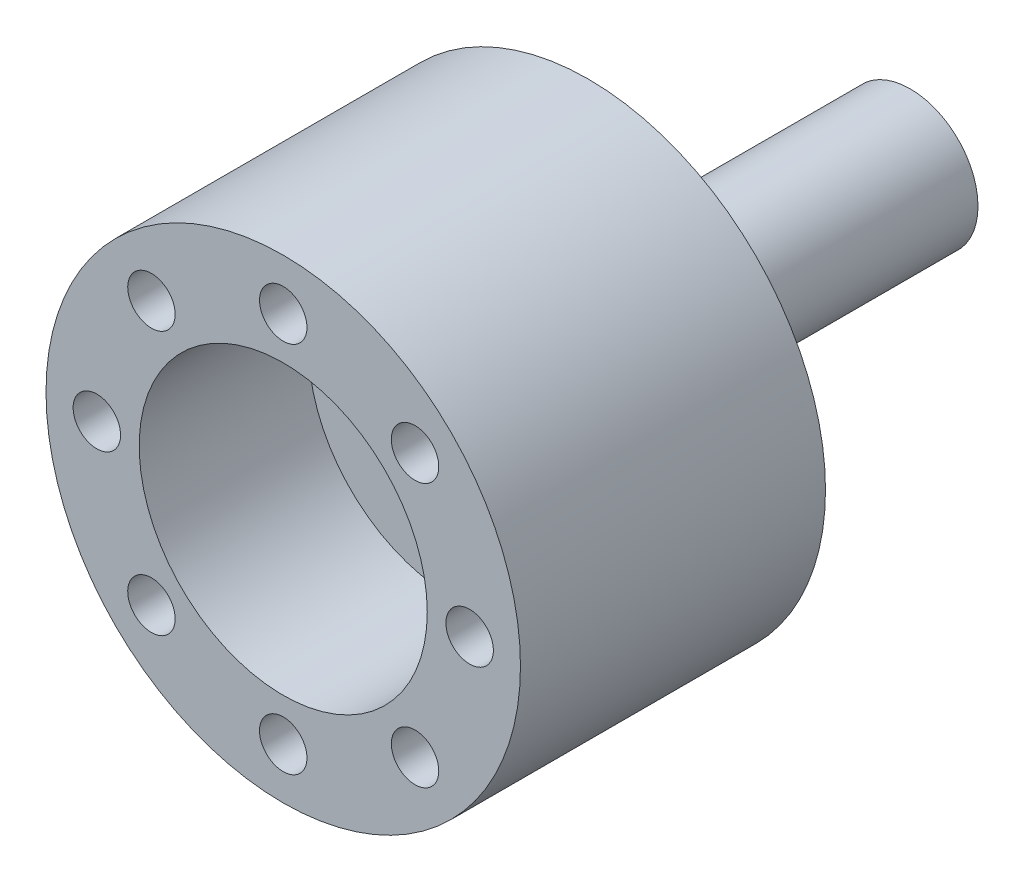
ISO-10303-21;
HEADER;
FILE_DESCRIPTION(('STEP AP214'),'2;1');
FILE_NAME('part.step','',(''),(''),'','','');
FILE_SCHEMA(('AUTOMOTIVE_DESIGN { 1 0 10303 214 1 1 1 1 }'));
ENDSEC;
DATA;
#1=APPLICATION_CONTEXT('core data for automotive mechanical design processes');
#2=APPLICATION_PROTOCOL_DEFINITION('international standard','automotive_design',2000,#1);
#3=PRODUCT_CONTEXT('',#1,'mechanical');
#4=PRODUCT('Part','Part','',(#3));
#5=PRODUCT_RELATED_PRODUCT_CATEGORY('part','',(#4));
#6=PRODUCT_DEFINITION_FORMATION('','',#4);
#7=PRODUCT_DEFINITION_CONTEXT('part definition',#1,'design');
#8=PRODUCT_DEFINITION('design','',#6,#7);
#9=PRODUCT_DEFINITION_SHAPE('','',#8);
#10=(LENGTH_UNIT() NAMED_UNIT(*) SI_UNIT(.MILLI.,.METRE.));
#11=(NAMED_UNIT(*) PLANE_ANGLE_UNIT() SI_UNIT($,.RADIAN.));
#12=(NAMED_UNIT(*) SI_UNIT($,.STERADIAN.) SOLID_ANGLE_UNIT());
#13=UNCERTAINTY_MEASURE_WITH_UNIT(LENGTH_MEASURE(1.E-05),#10,'distance_accuracy_value','');
#14=(GEOMETRIC_REPRESENTATION_CONTEXT(3) GLOBAL_UNCERTAINTY_ASSIGNED_CONTEXT((#13)) GLOBAL_UNIT_ASSIGNED_CONTEXT((#10,
#11,#12)) REPRESENTATION_CONTEXT('',''));
#15=CARTESIAN_POINT('',(0.,0.,0.));
#16=DIRECTION('',(0.,0.,1.));
#17=DIRECTION('',(1.,0.,0.));
#18=AXIS2_PLACEMENT_3D('',#15,#16,#17);
#19=CARTESIAN_POINT('',(4.6550416688057,4.17050201554713,3.));
#20=DIRECTION('',(0.,0.,1.));
#21=DIRECTION('',(1.,0.,0.));
#22=AXIS2_PLACEMENT_3D('',#19,#20,#21);
#23=CYLINDRICAL_SURFACE('',#22,1.45);
#24=CARTESIAN_POINT('',(4.6550416688057,4.17050201554713,8.));
#25=DIRECTION('',(0.,0.,1.));
#26=DIRECTION('',(1.,0.,0.));
#27=AXIS2_PLACEMENT_3D('',#24,#25,#26);
#28=CIRCLE('',#27,1.45);
#29=CARTESIAN_POINT('',(6.1050416688057,4.17050201554713,8.));
#30=VERTEX_POINT('',#29);
#31=EDGE_CURVE('E81',#30,#30,#28,.F.);
#32=ORIENTED_EDGE('',*,*,#31,.F.);
#33=EDGE_LOOP('',(#32));
#34=FACE_BOUND('',#33,.T.);
#35=CARTESIAN_POINT('',(4.6550416688057,4.17050201554713,5.));
#36=DIRECTION('',(0.,0.,-1.));
#37=DIRECTION('',(-1.,0.,0.));
#38=AXIS2_PLACEMENT_3D('',#35,#36,#37);
#39=CIRCLE('',#38,1.45);
#40=CARTESIAN_POINT('',(3.2050416688057,4.17050201554713,5.));
#41=VERTEX_POINT('',#40);
#42=EDGE_CURVE('E38',#41,#41,#39,.F.);
#43=ORIENTED_EDGE('',*,*,#42,.F.);
#44=EDGE_LOOP('',(#43));
#45=FACE_BOUND('',#44,.T.);
#46=ADVANCED_FACE('F34',(#34,#45),#23,.F.);
#47=CARTESIAN_POINT('',(-7.77817459305193,7.77817459305212,12.));
#48=DIRECTION('',(0.,0.,1.));
#49=DIRECTION('',(1.,0.,0.));
#50=AXIS2_PLACEMENT_3D('',#47,#48,#49);
#51=CYLINDRICAL_SURFACE('',#50,1.4);
#52=CARTESIAN_POINT('',(-7.77817459305193,7.77817459305212,18.));
#53=DIRECTION('',(0.,0.,1.));
#54=DIRECTION('',(0.707106781186556,0.707106781186539,0.));
#55=AXIS2_PLACEMENT_3D('',#52,#53,#54);
#56=CIRCLE('',#55,1.4);
#57=CARTESIAN_POINT('',(-6.78822509939075,8.76812408671327,18.));
#58=VERTEX_POINT('',#57);
#59=EDGE_CURVE('E55',#58,#58,#56,.T.);
#60=ORIENTED_EDGE('',*,*,#59,.T.);
#61=EDGE_LOOP('',(#60));
#62=FACE_BOUND('',#61,.T.);
#63=CARTESIAN_POINT('',(-7.77817459305193,7.77817459305212,15.));
#64=DIRECTION('',(0.,0.,-1.));
#65=DIRECTION('',(-1.,0.,0.));
#66=AXIS2_PLACEMENT_3D('',#63,#64,#65);
#67=CIRCLE('',#66,1.4);
#68=CARTESIAN_POINT('',(-9.17817459305193,7.77817459305212,15.));
#69=VERTEX_POINT('',#68);
#70=EDGE_CURVE('E78',#69,#69,#67,.F.);
#71=ORIENTED_EDGE('',*,*,#70,.F.);
#72=EDGE_LOOP('',(#71));
#73=FACE_BOUND('',#72,.T.);
#74=ADVANCED_FACE('F185',(#62,#73),#51,.F.);
#75=CARTESIAN_POINT('',(-11.,1.15218884181823E-13,12.));
#76=DIRECTION('',(0.,0.,1.));
#77=DIRECTION('',(1.,0.,0.));
#78=AXIS2_PLACEMENT_3D('',#75,#76,#77);
#79=CYLINDRICAL_SURFACE('',#78,1.4);
#80=CARTESIAN_POINT('',(-11.,1.15218884181823E-13,18.));
#81=DIRECTION('',(0.,0.,1.));
#82=DIRECTION('',(0.,1.,0.));
#83=AXIS2_PLACEMENT_3D('',#80,#81,#82);
#84=CIRCLE('',#83,1.4);
#85=CARTESIAN_POINT('',(-11.,1.40000000000012,18.));
#86=VERTEX_POINT('',#85);
#87=EDGE_CURVE('E156',#86,#86,#84,.T.);
#88=ORIENTED_EDGE('',*,*,#87,.T.);
#89=EDGE_LOOP('',(#88));
#90=FACE_BOUND('',#89,.T.);
#91=CARTESIAN_POINT('',(-11.,1.15218884181823E-13,15.));
#92=DIRECTION('',(0.,0.,-1.));
#93=DIRECTION('',(-1.,0.,0.));
#94=AXIS2_PLACEMENT_3D('',#91,#92,#93);
#95=CIRCLE('',#94,1.4);
#96=CARTESIAN_POINT('',(-12.4,1.15218884181823E-13,15.));
#97=VERTEX_POINT('',#96);
#98=EDGE_CURVE('E75',#97,#97,#95,.F.);
#99=ORIENTED_EDGE('',*,*,#98,.F.);
#100=EDGE_LOOP('',(#99));
#101=FACE_BOUND('',#100,.T.);
#102=ADVANCED_FACE('F190',(#90,#101),#79,.F.);
#103=CARTESIAN_POINT('',(-7.77817459305209,-7.77817459305195,12.));
#104=DIRECTION('',(0.,0.,1.));
#105=DIRECTION('',(1.,0.,0.));
#106=AXIS2_PLACEMENT_3D('',#103,#104,#105);
#107=CYLINDRICAL_SURFACE('',#106,1.4);
#108=CARTESIAN_POINT('',(-7.77817459305209,-7.77817459305195,18.));
#109=DIRECTION('',(0.,0.,1.));
#110=DIRECTION('',(-0.707106781186541,0.707106781186554,0.));
#111=AXIS2_PLACEMENT_3D('',#108,#109,#110);
#112=CIRCLE('',#111,1.4);
#113=CARTESIAN_POINT('',(-8.76812408671325,-6.78822509939078,18.));
#114=VERTEX_POINT('',#113);
#115=EDGE_CURVE('E153',#114,#114,#112,.T.);
#116=ORIENTED_EDGE('',*,*,#115,.T.);
#117=EDGE_LOOP('',(#116));
#118=FACE_BOUND('',#117,.T.);
#119=CARTESIAN_POINT('',(-7.77817459305209,-7.77817459305195,15.));
#120=DIRECTION('',(0.,0.,-1.));
#121=DIRECTION('',(-1.,0.,0.));
#122=AXIS2_PLACEMENT_3D('',#119,#120,#121);
#123=CIRCLE('',#122,1.4);
#124=CARTESIAN_POINT('',(-9.17817459305209,-7.77817459305195,15.));
#125=VERTEX_POINT('',#124);
#126=EDGE_CURVE('E72',#125,#125,#123,.F.);
#127=ORIENTED_EDGE('',*,*,#126,.F.);
#128=EDGE_LOOP('',(#127));
#129=FACE_BOUND('',#128,.T.);
#130=ADVANCED_FACE('F203',(#118,#129),#107,.F.);
#131=CARTESIAN_POINT('',(0.,-11.,12.));
#132=DIRECTION('',(0.,0.,1.));
#133=DIRECTION('',(1.,0.,0.));
#134=AXIS2_PLACEMENT_3D('',#131,#132,#133);
#135=CYLINDRICAL_SURFACE('',#134,1.4);
#136=CARTESIAN_POINT('',(0.,-11.,18.));
#137=DIRECTION('',(0.,0.,1.));
#138=DIRECTION('',(-1.,0.,0.));
#139=AXIS2_PLACEMENT_3D('',#136,#137,#138);
#140=CIRCLE('',#139,1.4);
#141=CARTESIAN_POINT('',(-1.4,-11.,18.));
#142=VERTEX_POINT('',#141);
#143=EDGE_CURVE('E150',#142,#142,#140,.T.);
#144=ORIENTED_EDGE('',*,*,#143,.T.);
#145=EDGE_LOOP('',(#144));
#146=FACE_BOUND('',#145,.T.);
#147=CARTESIAN_POINT('',(0.,-11.,15.));
#148=DIRECTION('',(0.,0.,-1.));
#149=DIRECTION('',(-1.,0.,0.));
#150=AXIS2_PLACEMENT_3D('',#147,#148,#149);
#151=CIRCLE('',#150,1.4);
#152=CARTESIAN_POINT('',(-1.4,-11.,15.));
#153=VERTEX_POINT('',#152);
#154=EDGE_CURVE('E69',#153,#153,#151,.F.);
#155=ORIENTED_EDGE('',*,*,#154,.F.);
#156=EDGE_LOOP('',(#155));
#157=FACE_BOUND('',#156,.T.);
#158=ADVANCED_FACE('F207',(#146,#157),#135,.F.);
#159=CARTESIAN_POINT('',(7.77817459305198,-7.77817459305206,12.));
#160=DIRECTION('',(0.,0.,1.));
#161=DIRECTION('',(1.,0.,0.));
#162=AXIS2_PLACEMENT_3D('',#159,#160,#161);
#163=CYLINDRICAL_SURFACE('',#162,1.4);
#164=CARTESIAN_POINT('',(7.77817459305198,-7.77817459305206,18.));
#165=DIRECTION('',(0.,0.,1.));
#166=DIRECTION('',(-0.707106781186551,-0.707106781186544,0.));
#167=AXIS2_PLACEMENT_3D('',#164,#165,#166);
#168=CIRCLE('',#167,1.4);
#169=CARTESIAN_POINT('',(6.78822509939081,-8.76812408671322,18.));
#170=VERTEX_POINT('',#169);
#171=EDGE_CURVE('E147',#170,#170,#168,.T.);
#172=ORIENTED_EDGE('',*,*,#171,.T.);
#173=EDGE_LOOP('',(#172));
#174=FACE_BOUND('',#173,.T.);
#175=CARTESIAN_POINT('',(7.77817459305198,-7.77817459305206,15.));
#176=DIRECTION('',(0.,0.,-1.));
#177=DIRECTION('',(-1.,0.,0.));
#178=AXIS2_PLACEMENT_3D('',#175,#176,#177);
#179=CIRCLE('',#178,1.4);
#180=CARTESIAN_POINT('',(6.37817459305198,-7.77817459305206,15.));
#181=VERTEX_POINT('',#180);
#182=EDGE_CURVE('E65',#181,#181,#179,.F.);
#183=ORIENTED_EDGE('',*,*,#182,.F.);
#184=EDGE_LOOP('',(#183));
#185=FACE_BOUND('',#184,.T.);
#186=ADVANCED_FACE('F211',(#174,#185),#163,.F.);
#187=CARTESIAN_POINT('',(11.,0.,12.));
#188=DIRECTION('',(0.,0.,1.));
#189=DIRECTION('',(1.,0.,0.));
#190=AXIS2_PLACEMENT_3D('',#187,#188,#189);
#191=CYLINDRICAL_SURFACE('',#190,1.4);
#192=CARTESIAN_POINT('',(11.,0.,18.));
#193=DIRECTION('',(0.,0.,1.));
#194=DIRECTION('',(0.,-1.,0.));
#195=AXIS2_PLACEMENT_3D('',#192,#193,#194);
#196=CIRCLE('',#195,1.4);
#197=CARTESIAN_POINT('',(11.,-1.40000000000004,18.));
#198=VERTEX_POINT('',#197);
#199=EDGE_CURVE('E143',#198,#198,#196,.T.);
#200=ORIENTED_EDGE('',*,*,#199,.T.);
#201=EDGE_LOOP('',(#200));
#202=FACE_BOUND('',#201,.T.);
#203=CARTESIAN_POINT('',(11.,0.,15.));
#204=DIRECTION('',(0.,0.,-1.));
#205=DIRECTION('',(-1.,0.,0.));
#206=AXIS2_PLACEMENT_3D('',#203,#204,#205);
#207=CIRCLE('',#206,1.4);
#208=CARTESIAN_POINT('',(9.6,0.,15.));
#209=VERTEX_POINT('',#208);
#210=EDGE_CURVE('E62',#209,#209,#207,.F.);
#211=ORIENTED_EDGE('',*,*,#210,.F.);
#212=EDGE_LOOP('',(#211));
#213=FACE_BOUND('',#212,.T.);
#214=ADVANCED_FACE('F199',(#202,#213),#191,.F.);
#215=CARTESIAN_POINT('',(7.77817459305204,7.77817459305201,12.));
#216=DIRECTION('',(0.,0.,1.));
#217=DIRECTION('',(1.,0.,0.));
#218=AXIS2_PLACEMENT_3D('',#215,#216,#217);
#219=CYLINDRICAL_SURFACE('',#218,1.4);
#220=CARTESIAN_POINT('',(7.77817459305204,7.77817459305201,18.));
#221=DIRECTION('',(0.,0.,1.));
#222=DIRECTION('',(0.707106781186546,-0.707106781186549,0.));
#223=AXIS2_PLACEMENT_3D('',#220,#221,#222);
#224=CIRCLE('',#223,1.4);
#225=CARTESIAN_POINT('',(8.7681240867132,6.78822509939084,18.));
#226=VERTEX_POINT('',#225);
#227=EDGE_CURVE('E146',#226,#226,#224,.T.);
#228=ORIENTED_EDGE('',*,*,#227,.T.);
#229=EDGE_LOOP('',(#228));
#230=FACE_BOUND('',#229,.T.);
#231=CARTESIAN_POINT('',(7.77817459305204,7.77817459305201,15.));
#232=DIRECTION('',(0.,0.,-1.));
#233=DIRECTION('',(-1.,0.,0.));
#234=AXIS2_PLACEMENT_3D('',#231,#232,#233);
#235=CIRCLE('',#234,1.4);
#236=CARTESIAN_POINT('',(6.37817459305204,7.77817459305201,15.));
#237=VERTEX_POINT('',#236);
#238=EDGE_CURVE('E57',#237,#237,#235,.F.);
#239=ORIENTED_EDGE('',*,*,#238,.F.);
#240=EDGE_LOOP('',(#239));
#241=FACE_BOUND('',#240,.T.);
#242=ADVANCED_FACE('F197',(#230,#241),#219,.F.);
#243=CARTESIAN_POINT('',(0.,11.,12.));
#244=DIRECTION('',(0.,0.,1.));
#245=DIRECTION('',(1.,0.,0.));
#246=AXIS2_PLACEMENT_3D('',#243,#244,#245);
#247=CYLINDRICAL_SURFACE('',#246,1.4);
#248=CARTESIAN_POINT('',(0.,11.,18.));
#249=DIRECTION('',(0.,0.,1.));
#250=DIRECTION('',(1.,0.,0.));
#251=AXIS2_PLACEMENT_3D('',#248,#249,#250);
#252=CIRCLE('',#251,1.4);
#253=CARTESIAN_POINT('',(1.4,11.,18.));
#254=VERTEX_POINT('',#253);
#255=EDGE_CURVE('E47',#254,#254,#252,.T.);
#256=ORIENTED_EDGE('',*,*,#255,.T.);
#257=EDGE_LOOP('',(#256));
#258=FACE_BOUND('',#257,.T.);
#259=CARTESIAN_POINT('',(0.,11.,15.));
#260=DIRECTION('',(0.,0.,-1.));
#261=DIRECTION('',(-1.,0.,0.));
#262=AXIS2_PLACEMENT_3D('',#259,#260,#261);
#263=CIRCLE('',#262,1.4);
#264=CARTESIAN_POINT('',(-1.4,11.,15.));
#265=VERTEX_POINT('',#264);
#266=EDGE_CURVE('E52',#265,#265,#263,.F.);
#267=ORIENTED_EDGE('',*,*,#266,.F.);
#268=EDGE_LOOP('',(#267));
#269=FACE_BOUND('',#268,.T.);
#270=ADVANCED_FACE('F166',(#258,#269),#247,.F.);
#271=CARTESIAN_POINT('',(0.,0.,18.));
#272=DIRECTION('',(0.,0.,-1.));
#273=DIRECTION('',(-1.,0.,0.));
#274=AXIS2_PLACEMENT_3D('',#271,#272,#273);
#275=CYLINDRICAL_SURFACE('',#274,14.);
#276=CARTESIAN_POINT('',(0.,0.,18.));
#277=DIRECTION('',(0.,0.,1.));
#278=DIRECTION('',(1.,0.,0.));
#279=AXIS2_PLACEMENT_3D('',#276,#277,#278);
#280=CIRCLE('',#279,14.);
#281=CARTESIAN_POINT('',(14.,0.,18.));
#282=VERTEX_POINT('',#281);
#283=EDGE_CURVE('E10',#282,#282,#280,.T.);
#284=ORIENTED_EDGE('',*,*,#283,.F.);
#285=EDGE_LOOP('',(#284));
#286=FACE_BOUND('',#285,.T.);
#287=CARTESIAN_POINT('',(0.,0.,0.));
#288=DIRECTION('',(0.,0.,1.));
#289=DIRECTION('',(1.,0.,0.));
#290=AXIS2_PLACEMENT_3D('',#287,#288,#289);
#291=CIRCLE('',#290,14.);
#292=CARTESIAN_POINT('',(14.,0.,0.));
#293=VERTEX_POINT('',#292);
#294=EDGE_CURVE('E42',#293,#293,#291,.T.);
#295=ORIENTED_EDGE('',*,*,#294,.T.);
#296=EDGE_LOOP('',(#295));
#297=FACE_BOUND('',#296,.T.);
#298=ADVANCED_FACE('F36',(#286,#297),#275,.T.);
#299=CARTESIAN_POINT('',(0.,0.,18.));
#300=DIRECTION('',(0.,0.,1.));
#301=DIRECTION('',(1.,0.,0.));
#302=AXIS2_PLACEMENT_3D('',#299,#300,#301);
#303=PLANE('',#302);
#304=CARTESIAN_POINT('',(0.,0.,18.));
#305=DIRECTION('',(0.,0.,1.));
#306=DIRECTION('',(1.,0.,0.));
#307=AXIS2_PLACEMENT_3D('',#304,#305,#306);
#308=CIRCLE('',#307,8.5);
#309=CARTESIAN_POINT('',(8.5,0.,18.));
#310=VERTEX_POINT('',#309);
#311=EDGE_CURVE('E91',#310,#310,#308,.T.);
#312=ORIENTED_EDGE('',*,*,#311,.F.);
#313=EDGE_LOOP('',(#312));
#314=FACE_BOUND('',#313,.T.);
#315=ORIENTED_EDGE('',*,*,#199,.F.);
#316=EDGE_LOOP('',(#315));
#317=FACE_BOUND('',#316,.T.);
#318=ORIENTED_EDGE('',*,*,#171,.F.);
#319=EDGE_LOOP('',(#318));
#320=FACE_BOUND('',#319,.T.);
#321=ORIENTED_EDGE('',*,*,#143,.F.);
#322=EDGE_LOOP('',(#321));
#323=FACE_BOUND('',#322,.T.);
#324=ORIENTED_EDGE('',*,*,#115,.F.);
#325=EDGE_LOOP('',(#324));
#326=FACE_BOUND('',#325,.T.);
#327=ORIENTED_EDGE('',*,*,#87,.F.);
#328=EDGE_LOOP('',(#327));
#329=FACE_BOUND('',#328,.T.);
#330=ORIENTED_EDGE('',*,*,#59,.F.);
#331=EDGE_LOOP('',(#330));
#332=FACE_BOUND('',#331,.T.);
#333=ORIENTED_EDGE('',*,*,#227,.F.);
#334=EDGE_LOOP('',(#333));
#335=FACE_BOUND('',#334,.T.);
#336=ORIENTED_EDGE('',*,*,#255,.F.);
#337=EDGE_LOOP('',(#336));
#338=FACE_BOUND('',#337,.T.);
#339=ORIENTED_EDGE('',*,*,#283,.T.);
#340=EDGE_LOOP('',(#339));
#341=FACE_BOUND('',#340,.T.);
#342=ADVANCED_FACE('F169',(#314,#317,#320,#323,#326,#329,#332,#335,#338,#341),#303,.T.);
#343=CARTESIAN_POINT('',(0.,0.,0.));
#344=DIRECTION('',(0.,0.,1.));
#345=DIRECTION('',(1.,0.,0.));
#346=AXIS2_PLACEMENT_3D('',#343,#344,#345);
#347=PLANE('',#346);
#348=CARTESIAN_POINT('',(0.,0.,0.));
#349=DIRECTION('',(0.,0.,-1.));
#350=DIRECTION('',(-1.,0.,0.));
#351=AXIS2_PLACEMENT_3D('',#348,#349,#350);
#352=CIRCLE('',#351,7.75);
#353=CARTESIAN_POINT('',(-7.75,0.,0.));
#354=VERTEX_POINT('',#353);
#355=EDGE_CURVE('E98',#354,#354,#352,.T.);
#356=ORIENTED_EDGE('',*,*,#355,.F.);
#357=EDGE_LOOP('',(#356));
#358=FACE_BOUND('',#357,.T.);
#359=CARTESIAN_POINT('',(11.,0.,0.));
#360=DIRECTION('',(0.,0.,-1.));
#361=DIRECTION('',(0.,1.,0.));
#362=AXIS2_PLACEMENT_3D('',#359,#360,#361);
#363=CIRCLE('',#362,2.25);
#364=CARTESIAN_POINT('',(11.,2.24999999999996,0.));
#365=VERTEX_POINT('',#364);
#366=EDGE_CURVE('E103',#365,#365,#363,.T.);
#367=ORIENTED_EDGE('',*,*,#366,.F.);
#368=EDGE_LOOP('',(#367));
#369=FACE_BOUND('',#368,.T.);
#370=CARTESIAN_POINT('',(7.77817459305198,-7.77817459305206,0.));
#371=DIRECTION('',(0.,0.,-1.));
#372=DIRECTION('',(0.707106781186551,0.707106781186544,0.));
#373=AXIS2_PLACEMENT_3D('',#370,#371,#372);
#374=CIRCLE('',#373,2.25);
#375=CARTESIAN_POINT('',(9.36916485072172,-6.18718433538234,0.));
#376=VERTEX_POINT('',#375);
#377=EDGE_CURVE('E109',#376,#376,#374,.T.);
#378=ORIENTED_EDGE('',*,*,#377,.F.);
#379=EDGE_LOOP('',(#378));
#380=FACE_BOUND('',#379,.T.);
#381=CARTESIAN_POINT('',(0.,-11.,0.));
#382=DIRECTION('',(0.,0.,-1.));
#383=DIRECTION('',(1.,0.,0.));
#384=AXIS2_PLACEMENT_3D('',#381,#382,#383);
#385=CIRCLE('',#384,2.25);
#386=CARTESIAN_POINT('',(2.25,-11.,0.));
#387=VERTEX_POINT('',#386);
#388=EDGE_CURVE('E115',#387,#387,#385,.T.);
#389=ORIENTED_EDGE('',*,*,#388,.F.);
#390=EDGE_LOOP('',(#389));
#391=FACE_BOUND('',#390,.T.);
#392=CARTESIAN_POINT('',(-7.77817459305209,-7.77817459305195,0.));
#393=DIRECTION('',(0.,0.,-1.));
#394=DIRECTION('',(0.707106781186541,-0.707106781186554,0.));
#395=AXIS2_PLACEMENT_3D('',#392,#393,#394);
#396=CIRCLE('',#395,2.25);
#397=CARTESIAN_POINT('',(-6.18718433538237,-9.3691648507217,0.));
#398=VERTEX_POINT('',#397);
#399=EDGE_CURVE('E121',#398,#398,#396,.T.);
#400=ORIENTED_EDGE('',*,*,#399,.F.);
#401=EDGE_LOOP('',(#400));
#402=FACE_BOUND('',#401,.T.);
#403=CARTESIAN_POINT('',(-11.,1.15218884181823E-13,0.));
#404=DIRECTION('',(0.,0.,-1.));
#405=DIRECTION('',(0.,-1.,0.));
#406=AXIS2_PLACEMENT_3D('',#403,#404,#405);
#407=CIRCLE('',#406,2.25);
#408=CARTESIAN_POINT('',(-11.,-2.24999999999988,0.));
#409=VERTEX_POINT('',#408);
#410=EDGE_CURVE('E127',#409,#409,#407,.T.);
#411=ORIENTED_EDGE('',*,*,#410,.F.);
#412=EDGE_LOOP('',(#411));
#413=FACE_BOUND('',#412,.T.);
#414=CARTESIAN_POINT('',(-7.77817459305193,7.77817459305212,0.));
#415=DIRECTION('',(0.,0.,-1.));
#416=DIRECTION('',(-0.707106781186556,-0.707106781186539,0.));
#417=AXIS2_PLACEMENT_3D('',#414,#415,#416);
#418=CIRCLE('',#417,2.25);
#419=CARTESIAN_POINT('',(-9.36916485072168,6.1871843353824,0.));
#420=VERTEX_POINT('',#419);
#421=EDGE_CURVE('E88',#420,#420,#418,.T.);
#422=ORIENTED_EDGE('',*,*,#421,.F.);
#423=EDGE_LOOP('',(#422));
#424=FACE_BOUND('',#423,.T.);
#425=CARTESIAN_POINT('',(7.77817459305204,7.77817459305201,0.));
#426=DIRECTION('',(0.,0.,-1.));
#427=DIRECTION('',(-0.707106781186546,0.707106781186549,0.));
#428=AXIS2_PLACEMENT_3D('',#425,#426,#427);
#429=CIRCLE('',#428,2.25);
#430=CARTESIAN_POINT('',(6.18718433538231,9.36916485072174,0.));
#431=VERTEX_POINT('',#430);
#432=EDGE_CURVE('E80',#431,#431,#429,.T.);
#433=ORIENTED_EDGE('',*,*,#432,.F.);
#434=EDGE_LOOP('',(#433));
#435=FACE_BOUND('',#434,.T.);
#436=CARTESIAN_POINT('',(0.,11.,0.));
#437=DIRECTION('',(0.,0.,-1.));
#438=DIRECTION('',(-1.,0.,0.));
#439=AXIS2_PLACEMENT_3D('',#436,#437,#438);
#440=CIRCLE('',#439,2.25);
#441=CARTESIAN_POINT('',(-2.25,11.,0.));
#442=VERTEX_POINT('',#441);
#443=EDGE_CURVE('E60',#442,#442,#440,.T.);
#444=ORIENTED_EDGE('',*,*,#443,.F.);
#445=EDGE_LOOP('',(#444));
#446=FACE_BOUND('',#445,.T.);
#447=ORIENTED_EDGE('',*,*,#294,.F.);
#448=EDGE_LOOP('',(#447));
#449=FACE_BOUND('',#448,.T.);
#450=ADVANCED_FACE('F171',(#358,#369,#380,#391,#402,#413,#424,#435,#446,#449),#347,.F.);
#451=CARTESIAN_POINT('',(0.,11.,15.));
#452=DIRECTION('',(0.,0.,-1.));
#453=DIRECTION('',(-1.,0.,0.));
#454=AXIS2_PLACEMENT_3D('',#451,#452,#453);
#455=PLANE('',#454);
#456=CARTESIAN_POINT('',(0.,11.,15.));
#457=DIRECTION('',(0.,0.,-1.));
#458=DIRECTION('',(-1.,0.,0.));
#459=AXIS2_PLACEMENT_3D('',#456,#457,#458);
#460=CIRCLE('',#459,2.25);
#461=CARTESIAN_POINT('',(-2.25,11.,15.));
#462=VERTEX_POINT('',#461);
#463=EDGE_CURVE('E56',#462,#462,#460,.T.);
#464=ORIENTED_EDGE('',*,*,#463,.T.);
#465=EDGE_LOOP('',(#464));
#466=FACE_BOUND('',#465,.T.);
#467=ORIENTED_EDGE('',*,*,#266,.T.);
#468=EDGE_LOOP('',(#467));
#469=FACE_BOUND('',#468,.T.);
#470=ADVANCED_FACE('F178',(#466,#469),#455,.T.);
#471=CARTESIAN_POINT('',(0.,11.,15.));
#472=DIRECTION('',(0.,0.,-1.));
#473=DIRECTION('',(-1.,0.,0.));
#474=AXIS2_PLACEMENT_3D('',#471,#472,#473);
#475=CYLINDRICAL_SURFACE('',#474,2.25);
#476=ORIENTED_EDGE('',*,*,#463,.F.);
#477=EDGE_LOOP('',(#476));
#478=FACE_BOUND('',#477,.T.);
#479=ORIENTED_EDGE('',*,*,#443,.T.);
#480=EDGE_LOOP('',(#479));
#481=FACE_BOUND('',#480,.T.);
#482=ADVANCED_FACE('F219',(#478,#481),#475,.F.);
#483=CARTESIAN_POINT('',(7.77817459305204,7.77817459305201,15.));
#484=DIRECTION('',(0.,0.,-1.));
#485=DIRECTION('',(-0.707106781186546,0.707106781186549,0.));
#486=AXIS2_PLACEMENT_3D('',#483,#484,#485);
#487=PLANE('',#486);
#488=CARTESIAN_POINT('',(7.77817459305204,7.77817459305201,15.));
#489=DIRECTION('',(0.,0.,-1.));
#490=DIRECTION('',(-0.707106781186546,0.707106781186549,0.));
#491=AXIS2_PLACEMENT_3D('',#488,#489,#490);
#492=CIRCLE('',#491,2.25);
#493=CARTESIAN_POINT('',(6.18718433538231,9.36916485072174,15.));
#494=VERTEX_POINT('',#493);
#495=EDGE_CURVE('E61',#494,#494,#492,.T.);
#496=ORIENTED_EDGE('',*,*,#495,.T.);
#497=EDGE_LOOP('',(#496));
#498=FACE_BOUND('',#497,.T.);
#499=ORIENTED_EDGE('',*,*,#238,.T.);
#500=EDGE_LOOP('',(#499));
#501=FACE_BOUND('',#500,.T.);
#502=ADVANCED_FACE('F222',(#498,#501),#487,.T.);
#503=CARTESIAN_POINT('',(7.77817459305204,7.77817459305201,15.));
#504=DIRECTION('',(0.,0.,-1.));
#505=DIRECTION('',(-1.,0.,0.));
#506=AXIS2_PLACEMENT_3D('',#503,#504,#505);
#507=CYLINDRICAL_SURFACE('',#506,2.25);
#508=ORIENTED_EDGE('',*,*,#495,.F.);
#509=EDGE_LOOP('',(#508));
#510=FACE_BOUND('',#509,.T.);
#511=ORIENTED_EDGE('',*,*,#432,.T.);
#512=EDGE_LOOP('',(#511));
#513=FACE_BOUND('',#512,.T.);
#514=ADVANCED_FACE('F227',(#510,#513),#507,.F.);
#515=CARTESIAN_POINT('',(11.,0.,15.));
#516=DIRECTION('',(0.,0.,-1.));
#517=DIRECTION('',(0.,1.,0.));
#518=AXIS2_PLACEMENT_3D('',#515,#516,#517);
#519=PLANE('',#518);
#520=CARTESIAN_POINT('',(11.,0.,15.));
#521=DIRECTION('',(0.,0.,-1.));
#522=DIRECTION('',(0.,1.,0.));
#523=AXIS2_PLACEMENT_3D('',#520,#521,#522);
#524=CIRCLE('',#523,2.25);
#525=CARTESIAN_POINT('',(11.,2.24999999999996,15.));
#526=VERTEX_POINT('',#525);
#527=EDGE_CURVE('E66',#526,#526,#524,.T.);
#528=ORIENTED_EDGE('',*,*,#527,.T.);
#529=EDGE_LOOP('',(#528));
#530=FACE_BOUND('',#529,.T.);
#531=ORIENTED_EDGE('',*,*,#210,.T.);
#532=EDGE_LOOP('',(#531));
#533=FACE_BOUND('',#532,.T.);
#534=ADVANCED_FACE('F230',(#530,#533),#519,.T.);
#535=CARTESIAN_POINT('',(11.,0.,15.));
#536=DIRECTION('',(0.,0.,-1.));
#537=DIRECTION('',(-1.,0.,0.));
#538=AXIS2_PLACEMENT_3D('',#535,#536,#537);
#539=CYLINDRICAL_SURFACE('',#538,2.25);
#540=ORIENTED_EDGE('',*,*,#527,.F.);
#541=EDGE_LOOP('',(#540));
#542=FACE_BOUND('',#541,.T.);
#543=ORIENTED_EDGE('',*,*,#366,.T.);
#544=EDGE_LOOP('',(#543));
#545=FACE_BOUND('',#544,.T.);
#546=ADVANCED_FACE('F275',(#542,#545),#539,.F.);
#547=CARTESIAN_POINT('',(7.77817459305198,-7.77817459305206,15.));
#548=DIRECTION('',(0.,0.,-1.));
#549=DIRECTION('',(0.707106781186551,0.707106781186544,0.));
#550=AXIS2_PLACEMENT_3D('',#547,#548,#549);
#551=PLANE('',#550);
#552=CARTESIAN_POINT('',(7.77817459305198,-7.77817459305206,15.));
#553=DIRECTION('',(0.,0.,-1.));
#554=DIRECTION('',(0.707106781186551,0.707106781186544,0.));
#555=AXIS2_PLACEMENT_3D('',#552,#553,#554);
#556=CIRCLE('',#555,2.25);
#557=CARTESIAN_POINT('',(9.36916485072172,-6.18718433538234,15.));
#558=VERTEX_POINT('',#557);
#559=EDGE_CURVE('E106',#558,#558,#556,.T.);
#560=ORIENTED_EDGE('',*,*,#559,.T.);
#561=EDGE_LOOP('',(#560));
#562=FACE_BOUND('',#561,.T.);
#563=ORIENTED_EDGE('',*,*,#182,.T.);
#564=EDGE_LOOP('',(#563));
#565=FACE_BOUND('',#564,.T.);
#566=ADVANCED_FACE('F271',(#562,#565),#551,.T.);
#567=CARTESIAN_POINT('',(7.77817459305198,-7.77817459305206,15.));
#568=DIRECTION('',(0.,0.,-1.));
#569=DIRECTION('',(-1.,0.,0.));
#570=AXIS2_PLACEMENT_3D('',#567,#568,#569);
#571=CYLINDRICAL_SURFACE('',#570,2.25);
#572=ORIENTED_EDGE('',*,*,#559,.F.);
#573=EDGE_LOOP('',(#572));
#574=FACE_BOUND('',#573,.T.);
#575=ORIENTED_EDGE('',*,*,#377,.T.);
#576=EDGE_LOOP('',(#575));
#577=FACE_BOUND('',#576,.T.);
#578=ADVANCED_FACE('F267',(#574,#577),#571,.F.);
#579=CARTESIAN_POINT('',(0.,-11.,15.));
#580=DIRECTION('',(0.,0.,-1.));
#581=DIRECTION('',(1.,0.,0.));
#582=AXIS2_PLACEMENT_3D('',#579,#580,#581);
#583=PLANE('',#582);
#584=CARTESIAN_POINT('',(0.,-11.,15.));
#585=DIRECTION('',(0.,0.,-1.));
#586=DIRECTION('',(1.,0.,0.));
#587=AXIS2_PLACEMENT_3D('',#584,#585,#586);
#588=CIRCLE('',#587,2.25);
#589=CARTESIAN_POINT('',(2.25,-11.,15.));
#590=VERTEX_POINT('',#589);
#591=EDGE_CURVE('E112',#590,#590,#588,.T.);
#592=ORIENTED_EDGE('',*,*,#591,.T.);
#593=EDGE_LOOP('',(#592));
#594=FACE_BOUND('',#593,.T.);
#595=ORIENTED_EDGE('',*,*,#154,.T.);
#596=EDGE_LOOP('',(#595));
#597=FACE_BOUND('',#596,.T.);
#598=ADVANCED_FACE('F263',(#594,#597),#583,.T.);
#599=CARTESIAN_POINT('',(0.,-11.,15.));
#600=DIRECTION('',(0.,0.,-1.));
#601=DIRECTION('',(-1.,0.,0.));
#602=AXIS2_PLACEMENT_3D('',#599,#600,#601);
#603=CYLINDRICAL_SURFACE('',#602,2.25);
#604=ORIENTED_EDGE('',*,*,#591,.F.);
#605=EDGE_LOOP('',(#604));
#606=FACE_BOUND('',#605,.T.);
#607=ORIENTED_EDGE('',*,*,#388,.T.);
#608=EDGE_LOOP('',(#607));
#609=FACE_BOUND('',#608,.T.);
#610=ADVANCED_FACE('F259',(#606,#609),#603,.F.);
#611=CARTESIAN_POINT('',(-7.77817459305209,-7.77817459305195,15.));
#612=DIRECTION('',(0.,0.,-1.));
#613=DIRECTION('',(0.707106781186541,-0.707106781186554,0.));
#614=AXIS2_PLACEMENT_3D('',#611,#612,#613);
#615=PLANE('',#614);
#616=CARTESIAN_POINT('',(-7.77817459305209,-7.77817459305195,15.));
#617=DIRECTION('',(0.,0.,-1.));
#618=DIRECTION('',(0.707106781186541,-0.707106781186554,0.));
#619=AXIS2_PLACEMENT_3D('',#616,#617,#618);
#620=CIRCLE('',#619,2.25);
#621=CARTESIAN_POINT('',(-6.18718433538237,-9.3691648507217,15.));
#622=VERTEX_POINT('',#621);
#623=EDGE_CURVE('E118',#622,#622,#620,.T.);
#624=ORIENTED_EDGE('',*,*,#623,.T.);
#625=EDGE_LOOP('',(#624));
#626=FACE_BOUND('',#625,.T.);
#627=ORIENTED_EDGE('',*,*,#126,.T.);
#628=EDGE_LOOP('',(#627));
#629=FACE_BOUND('',#628,.T.);
#630=ADVANCED_FACE('F255',(#626,#629),#615,.T.);
#631=CARTESIAN_POINT('',(-7.77817459305209,-7.77817459305195,15.));
#632=DIRECTION('',(0.,0.,-1.));
#633=DIRECTION('',(-1.,0.,0.));
#634=AXIS2_PLACEMENT_3D('',#631,#632,#633);
#635=CYLINDRICAL_SURFACE('',#634,2.25);
#636=ORIENTED_EDGE('',*,*,#623,.F.);
#637=EDGE_LOOP('',(#636));
#638=FACE_BOUND('',#637,.T.);
#639=ORIENTED_EDGE('',*,*,#399,.T.);
#640=EDGE_LOOP('',(#639));
#641=FACE_BOUND('',#640,.T.);
#642=ADVANCED_FACE('F251',(#638,#641),#635,.F.);
#643=CARTESIAN_POINT('',(-11.,1.15218884181823E-13,15.));
#644=DIRECTION('',(0.,0.,-1.));
#645=DIRECTION('',(0.,-1.,0.));
#646=AXIS2_PLACEMENT_3D('',#643,#644,#645);
#647=PLANE('',#646);
#648=CARTESIAN_POINT('',(-11.,1.15218884181823E-13,15.));
#649=DIRECTION('',(0.,0.,-1.));
#650=DIRECTION('',(0.,-1.,0.));
#651=AXIS2_PLACEMENT_3D('',#648,#649,#650);
#652=CIRCLE('',#651,2.25);
#653=CARTESIAN_POINT('',(-11.,-2.24999999999988,15.));
#654=VERTEX_POINT('',#653);
#655=EDGE_CURVE('E124',#654,#654,#652,.T.);
#656=ORIENTED_EDGE('',*,*,#655,.T.);
#657=EDGE_LOOP('',(#656));
#658=FACE_BOUND('',#657,.T.);
#659=ORIENTED_EDGE('',*,*,#98,.T.);
#660=EDGE_LOOP('',(#659));
#661=FACE_BOUND('',#660,.T.);
#662=ADVANCED_FACE('F247',(#658,#661),#647,.T.);
#663=CARTESIAN_POINT('',(-11.,1.15218884181823E-13,15.));
#664=DIRECTION('',(0.,0.,-1.));
#665=DIRECTION('',(-1.,0.,0.));
#666=AXIS2_PLACEMENT_3D('',#663,#664,#665);
#667=CYLINDRICAL_SURFACE('',#666,2.25);
#668=ORIENTED_EDGE('',*,*,#655,.F.);
#669=EDGE_LOOP('',(#668));
#670=FACE_BOUND('',#669,.T.);
#671=ORIENTED_EDGE('',*,*,#410,.T.);
#672=EDGE_LOOP('',(#671));
#673=FACE_BOUND('',#672,.T.);
#674=ADVANCED_FACE('F243',(#670,#673),#667,.F.);
#675=CARTESIAN_POINT('',(-7.77817459305193,7.77817459305212,15.));
#676=DIRECTION('',(0.,0.,-1.));
#677=DIRECTION('',(-0.707106781186556,-0.707106781186539,0.));
#678=AXIS2_PLACEMENT_3D('',#675,#676,#677);
#679=PLANE('',#678);
#680=CARTESIAN_POINT('',(-7.77817459305193,7.77817459305212,15.));
#681=DIRECTION('',(0.,0.,-1.));
#682=DIRECTION('',(-0.707106781186556,-0.707106781186539,0.));
#683=AXIS2_PLACEMENT_3D('',#680,#681,#682);
#684=CIRCLE('',#683,2.25);
#685=CARTESIAN_POINT('',(-9.36916485072168,6.1871843353824,15.));
#686=VERTEX_POINT('',#685);
#687=EDGE_CURVE('E130',#686,#686,#684,.T.);
#688=ORIENTED_EDGE('',*,*,#687,.T.);
#689=EDGE_LOOP('',(#688));
#690=FACE_BOUND('',#689,.T.);
#691=ORIENTED_EDGE('',*,*,#70,.T.);
#692=EDGE_LOOP('',(#691));
#693=FACE_BOUND('',#692,.T.);
#694=ADVANCED_FACE('F239',(#690,#693),#679,.T.);
#695=CARTESIAN_POINT('',(-7.77817459305193,7.77817459305212,15.));
#696=DIRECTION('',(0.,0.,-1.));
#697=DIRECTION('',(-1.,0.,0.));
#698=AXIS2_PLACEMENT_3D('',#695,#696,#697);
#699=CYLINDRICAL_SURFACE('',#698,2.25);
#700=ORIENTED_EDGE('',*,*,#687,.F.);
#701=EDGE_LOOP('',(#700));
#702=FACE_BOUND('',#701,.T.);
#703=ORIENTED_EDGE('',*,*,#421,.T.);
#704=EDGE_LOOP('',(#703));
#705=FACE_BOUND('',#704,.T.);
#706=ADVANCED_FACE('F235',(#702,#705),#699,.F.);
#707=CARTESIAN_POINT('',(0.,0.,8.));
#708=DIRECTION('',(0.,0.,1.));
#709=DIRECTION('',(1.,0.,0.));
#710=AXIS2_PLACEMENT_3D('',#707,#708,#709);
#711=PLANE('',#710);
#712=CARTESIAN_POINT('',(0.,0.,8.));
#713=DIRECTION('',(0.,0.,1.));
#714=DIRECTION('',(1.,0.,0.));
#715=AXIS2_PLACEMENT_3D('',#712,#713,#714);
#716=CIRCLE('',#715,8.5);
#717=CARTESIAN_POINT('',(8.5,0.,8.));
#718=VERTEX_POINT('',#717);
#719=EDGE_CURVE('E84',#718,#718,#716,.T.);
#720=ORIENTED_EDGE('',*,*,#719,.T.);
#721=EDGE_LOOP('',(#720));
#722=FACE_BOUND('',#721,.T.);
#723=ORIENTED_EDGE('',*,*,#31,.T.);
#724=EDGE_LOOP('',(#723));
#725=FACE_BOUND('',#724,.T.);
#726=ADVANCED_FACE('F238',(#722,#725),#711,.T.);
#727=CARTESIAN_POINT('',(0.,0.,8.));
#728=DIRECTION('',(0.,0.,1.));
#729=DIRECTION('',(1.,0.,0.));
#730=AXIS2_PLACEMENT_3D('',#727,#728,#729);
#731=CYLINDRICAL_SURFACE('',#730,8.5);
#732=ORIENTED_EDGE('',*,*,#719,.F.);
#733=EDGE_LOOP('',(#732));
#734=FACE_BOUND('',#733,.T.);
#735=ORIENTED_EDGE('',*,*,#311,.T.);
#736=EDGE_LOOP('',(#735));
#737=FACE_BOUND('',#736,.T.);
#738=ADVANCED_FACE('F293',(#734,#737),#731,.F.);
#739=CARTESIAN_POINT('',(0.,0.,5.));
#740=DIRECTION('',(0.,0.,-1.));
#741=DIRECTION('',(-1.,0.,0.));
#742=AXIS2_PLACEMENT_3D('',#739,#740,#741);
#743=PLANE('',#742);
#744=CARTESIAN_POINT('',(0.,0.,5.));
#745=DIRECTION('',(0.,0.,-1.));
#746=DIRECTION('',(-1.,0.,0.));
#747=AXIS2_PLACEMENT_3D('',#744,#745,#746);
#748=CIRCLE('',#747,4.75);
#749=CARTESIAN_POINT('',(-4.75,0.,5.));
#750=VERTEX_POINT('',#749);
#751=EDGE_CURVE('E334',#750,#750,#748,.T.);
#752=ORIENTED_EDGE('',*,*,#751,.F.);
#753=EDGE_LOOP('',(#752));
#754=FACE_BOUND('',#753,.T.);
#755=CARTESIAN_POINT('',(0.,0.,5.));
#756=DIRECTION('',(0.,0.,-1.));
#757=DIRECTION('',(-1.,0.,0.));
#758=AXIS2_PLACEMENT_3D('',#755,#756,#757);
#759=CIRCLE('',#758,7.75);
#760=CARTESIAN_POINT('',(-7.75,0.,5.));
#761=VERTEX_POINT('',#760);
#762=EDGE_CURVE('E338',#761,#761,#759,.T.);
#763=ORIENTED_EDGE('',*,*,#762,.T.);
#764=EDGE_LOOP('',(#763));
#765=FACE_BOUND('',#764,.T.);
#766=ORIENTED_EDGE('',*,*,#42,.T.);
#767=EDGE_LOOP('',(#766));
#768=FACE_BOUND('',#767,.T.);
#769=ADVANCED_FACE('F296',(#754,#765,#768),#743,.T.);
#770=CARTESIAN_POINT('',(0.,0.,5.));
#771=DIRECTION('',(0.,0.,-1.));
#772=DIRECTION('',(-1.,0.,0.));
#773=AXIS2_PLACEMENT_3D('',#770,#771,#772);
#774=CYLINDRICAL_SURFACE('',#773,7.75);
#775=ORIENTED_EDGE('',*,*,#762,.F.);
#776=EDGE_LOOP('',(#775));
#777=FACE_BOUND('',#776,.T.);
#778=ORIENTED_EDGE('',*,*,#355,.T.);
#779=EDGE_LOOP('',(#778));
#780=FACE_BOUND('',#779,.T.);
#781=ADVANCED_FACE('F300',(#777,#780),#774,.F.);
#782=CARTESIAN_POINT('',(0.,0.,5.));
#783=DIRECTION('',(0.,0.,-1.));
#784=DIRECTION('',(-1.,0.,0.));
#785=AXIS2_PLACEMENT_3D('',#782,#783,#784);
#786=CYLINDRICAL_SURFACE('',#785,4.75);
#787=ORIENTED_EDGE('',*,*,#751,.T.);
#788=EDGE_LOOP('',(#787));
#789=FACE_BOUND('',#788,.T.);
#790=CARTESIAN_POINT('',(0.,0.,0.));
#791=DIRECTION('',(0.,0.,-1.));
#792=DIRECTION('',(-1.,0.,0.));
#793=AXIS2_PLACEMENT_3D('',#790,#791,#792);
#794=CIRCLE('',#793,4.75);
#795=CARTESIAN_POINT('',(-4.75,0.,0.));
#796=VERTEX_POINT('',#795);
#797=EDGE_CURVE('E329',#796,#796,#794,.T.);
#798=ORIENTED_EDGE('',*,*,#797,.F.);
#799=EDGE_LOOP('',(#798));
#800=FACE_BOUND('',#799,.T.);
#801=ADVANCED_FACE('F303',(#789,#800),#786,.T.);
#802=CARTESIAN_POINT('',(0.,0.,0.));
#803=DIRECTION('',(0.,0.,1.));
#804=DIRECTION('',(1.,0.,0.));
#805=AXIS2_PLACEMENT_3D('',#802,#803,#804);
#806=CONICAL_SURFACE('',#805,4.75,0.448761316801912);
#807=CARTESIAN_POINT('',(0.,0.,-1.55754099018904));
#808=DIRECTION('',(0.,0.,1.));
#809=DIRECTION('',(1.,0.,0.));
#810=AXIS2_PLACEMENT_3D('',#807,#808,#809);
#811=CIRCLE('',#810,4.);
#812=CARTESIAN_POINT('',(4.,0.,-1.55754099018904));
#813=VERTEX_POINT('',#812);
#814=EDGE_CURVE('E325',#813,#813,#811,.T.);
#815=ORIENTED_EDGE('',*,*,#814,.T.);
#816=EDGE_LOOP('',(#815));
#817=FACE_BOUND('',#816,.T.);
#818=ORIENTED_EDGE('',*,*,#797,.T.);
#819=EDGE_LOOP('',(#818));
#820=FACE_BOUND('',#819,.T.);
#821=ADVANCED_FACE('F291',(#817,#820),#806,.T.);
#822=CARTESIAN_POINT('',(0.,0.,-19.));
#823=DIRECTION('',(0.,0.,-1.));
#824=DIRECTION('',(-1.,0.,0.));
#825=AXIS2_PLACEMENT_3D('',#822,#823,#824);
#826=PLANE('',#825);
#827=CARTESIAN_POINT('',(0.,0.,-19.));
#828=DIRECTION('',(0.,0.,-1.));
#829=DIRECTION('',(-1.,0.,0.));
#830=AXIS2_PLACEMENT_3D('',#827,#828,#829);
#831=CIRCLE('',#830,3.25);
#832=CARTESIAN_POINT('',(-3.25,0.,-19.));
#833=VERTEX_POINT('',#832);
#834=EDGE_CURVE('E326',#833,#833,#831,.T.);
#835=ORIENTED_EDGE('',*,*,#834,.F.);
#836=EDGE_LOOP('',(#835));
#837=FACE_BOUND('',#836,.T.);
#838=CARTESIAN_POINT('',(0.,0.,-19.));
#839=DIRECTION('',(0.,0.,-1.));
#840=DIRECTION('',(-1.,0.,0.));
#841=AXIS2_PLACEMENT_3D('',#838,#839,#840);
#842=CIRCLE('',#841,4.);
#843=CARTESIAN_POINT('',(-4.,0.,-19.));
#844=VERTEX_POINT('',#843);
#845=EDGE_CURVE('E83',#844,#844,#842,.T.);
#846=ORIENTED_EDGE('',*,*,#845,.T.);
#847=EDGE_LOOP('',(#846));
#848=FACE_BOUND('',#847,.T.);
#849=ADVANCED_FACE('F287',(#837,#848),#826,.T.);
#850=CARTESIAN_POINT('',(0.,0.,-19.));
#851=DIRECTION('',(0.,0.,1.));
#852=DIRECTION('',(1.,0.,0.));
#853=AXIS2_PLACEMENT_3D('',#850,#851,#852);
#854=CYLINDRICAL_SURFACE('',#853,4.);
#855=ORIENTED_EDGE('',*,*,#814,.F.);
#856=EDGE_LOOP('',(#855));
#857=FACE_BOUND('',#856,.T.);
#858=ORIENTED_EDGE('',*,*,#845,.F.);
#859=EDGE_LOOP('',(#858));
#860=FACE_BOUND('',#859,.T.);
#861=ADVANCED_FACE('F283',(#857,#860),#854,.T.);
#862=CARTESIAN_POINT('',(0.,0.,-16.5));
#863=DIRECTION('',(0.,0.,-1.));
#864=DIRECTION('',(-1.,0.,0.));
#865=AXIS2_PLACEMENT_3D('',#862,#863,#864);
#866=CYLINDRICAL_SURFACE('',#865,3.25);
#867=CARTESIAN_POINT('',(0.,0.,-16.5));
#868=DIRECTION('',(0.,0.,-1.));
#869=DIRECTION('',(-1.,0.,0.));
#870=AXIS2_PLACEMENT_3D('',#867,#868,#869);
#871=CIRCLE('',#870,3.25);
#872=CARTESIAN_POINT('',(-3.25,0.,-16.5));
#873=VERTEX_POINT('',#872);
#874=EDGE_CURVE('E324',#873,#873,#871,.T.);
#875=ORIENTED_EDGE('',*,*,#874,.F.);
#876=EDGE_LOOP('',(#875));
#877=FACE_BOUND('',#876,.T.);
#878=ORIENTED_EDGE('',*,*,#834,.T.);
#879=EDGE_LOOP('',(#878));
#880=FACE_BOUND('',#879,.T.);
#881=ADVANCED_FACE('F286',(#877,#880),#866,.F.);
#882=CARTESIAN_POINT('',(0.,0.,-16.5));
#883=DIRECTION('',(0.,0.,-1.));
#884=DIRECTION('',(-1.,0.,0.));
#885=AXIS2_PLACEMENT_3D('',#882,#883,#884);
#886=PLANE('',#885);
#887=ORIENTED_EDGE('',*,*,#874,.T.);
#888=EDGE_LOOP('',(#887));
#889=FACE_BOUND('',#888,.T.);
#890=ADVANCED_FACE('F316',(#889),#886,.T.);
#891=CLOSED_SHELL('',(#46,#74,#102,#130,#158,#186,#214,#242,#270,#298,#342,#450,#470,#482,#502,
#514,#534,#546,#566,#578,#598,#610,#630,#642,#662,#674,#694,#706,#726,#738,#769,#781,#801,#821,
#849,#861,#881,#890));
#892=MANIFOLD_SOLID_BREP('B2',#891);
#893=ADVANCED_BREP_SHAPE_REPRESENTATION('',(#18,#892),#14);
#894=SHAPE_DEFINITION_REPRESENTATION(#9,#893);
ENDSEC;
END-ISO-10303-21;
